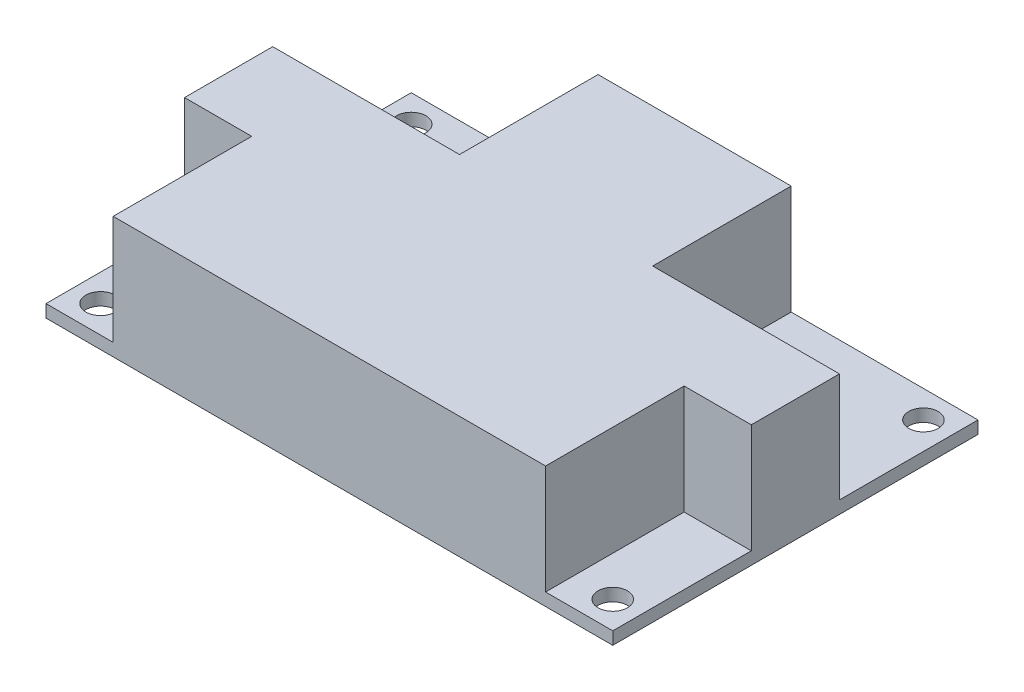
ISO-10303-21;
HEADER;
FILE_DESCRIPTION(('STEP AP214'),'2;1');
FILE_NAME('part.step','',(''),(''),'','','');
FILE_SCHEMA(('AUTOMOTIVE_DESIGN { 1 0 10303 214 1 1 1 1 }'));
ENDSEC;
DATA;
#1=APPLICATION_CONTEXT('core data for automotive mechanical design processes');
#2=APPLICATION_PROTOCOL_DEFINITION('international standard','automotive_design',2000,#1);
#3=PRODUCT_CONTEXT('',#1,'mechanical');
#4=PRODUCT('Part','Part','',(#3));
#5=PRODUCT_RELATED_PRODUCT_CATEGORY('part','',(#4));
#6=PRODUCT_DEFINITION_FORMATION('','',#4);
#7=PRODUCT_DEFINITION_CONTEXT('part definition',#1,'design');
#8=PRODUCT_DEFINITION('design','',#6,#7);
#9=PRODUCT_DEFINITION_SHAPE('','',#8);
#10=(LENGTH_UNIT() NAMED_UNIT(*) SI_UNIT(.MILLI.,.METRE.));
#11=(NAMED_UNIT(*) PLANE_ANGLE_UNIT() SI_UNIT($,.RADIAN.));
#12=(NAMED_UNIT(*) SI_UNIT($,.STERADIAN.) SOLID_ANGLE_UNIT());
#13=UNCERTAINTY_MEASURE_WITH_UNIT(LENGTH_MEASURE(1.E-05),#10,'distance_accuracy_value','');
#14=(GEOMETRIC_REPRESENTATION_CONTEXT(3) GLOBAL_UNCERTAINTY_ASSIGNED_CONTEXT((#13)) GLOBAL_UNIT_ASSIGNED_CONTEXT((#10,
#11,#12)) REPRESENTATION_CONTEXT('',''));
#15=CARTESIAN_POINT('',(0.,0.,0.));
#16=DIRECTION('',(0.,0.,1.));
#17=DIRECTION('',(1.,0.,0.));
#18=AXIS2_PLACEMENT_3D('',#15,#16,#17);
#19=CARTESIAN_POINT('',(0.,1.5,0.));
#20=DIRECTION('',(0.,-1.,0.));
#21=DIRECTION('',(0.,0.,-1.));
#22=AXIS2_PLACEMENT_3D('',#19,#20,#21);
#23=PLANE('',#22);
#24=CARTESIAN_POINT('',(3.25,1.5,-40.25));
#25=DIRECTION('',(0.,1.,0.));
#26=DIRECTION('',(0.,0.,1.));
#27=AXIS2_PLACEMENT_3D('',#24,#25,#26);
#28=CIRCLE('',#27,1.75);
#29=CARTESIAN_POINT('',(3.25,1.5,-38.5));
#30=VERTEX_POINT('',#29);
#31=EDGE_CURVE('E201',#30,#30,#28,.T.);
#32=ORIENTED_EDGE('',*,*,#31,.F.);
#33=EDGE_LOOP('',(#32));
#34=FACE_BOUND('',#33,.T.);
#35=DIRECTION('',(-1.,0.,0.));
#36=VECTOR('',#35,1.);
#37=CARTESIAN_POINT('',(0.,1.5,-27.));
#38=LINE('',#37,#36);
#39=CARTESIAN_POINT('',(22.25,1.5,-27.));
#40=VERTEX_POINT('',#39);
#41=CARTESIAN_POINT('',(0.,1.5,-27.));
#42=VERTEX_POINT('',#41);
#43=EDGE_CURVE('E54',#40,#42,#38,.T.);
#44=ORIENTED_EDGE('',*,*,#43,.F.);
#45=DIRECTION('',(0.,0.,1.));
#46=VECTOR('',#45,1.);
#47=CARTESIAN_POINT('',(22.25,1.5,-43.5));
#48=LINE('',#47,#46);
#49=CARTESIAN_POINT('',(22.25,1.5,-43.5));
#50=VERTEX_POINT('',#49);
#51=EDGE_CURVE('E257',#50,#40,#48,.T.);
#52=ORIENTED_EDGE('',*,*,#51,.F.);
#53=DIRECTION('',(-1.,0.,0.));
#54=VECTOR('',#53,1.);
#55=CARTESIAN_POINT('',(0.,1.5,-43.5));
#56=LINE('',#55,#54);
#57=CARTESIAN_POINT('',(0.,1.5,-43.5));
#58=VERTEX_POINT('',#57);
#59=EDGE_CURVE('E215',#50,#58,#56,.T.);
#60=ORIENTED_EDGE('',*,*,#59,.T.);
#61=DIRECTION('',(0.,0.,1.));
#62=VECTOR('',#61,1.);
#63=CARTESIAN_POINT('',(0.,1.5,0.));
#64=LINE('',#63,#62);
#65=EDGE_CURVE('E207',#58,#42,#64,.T.);
#66=ORIENTED_EDGE('',*,*,#65,.T.);
#67=EDGE_LOOP('',(#44,#52,#60,#66));
#68=FACE_BOUND('',#67,.T.);
#69=ADVANCED_FACE('F39',(#34,#68),#23,.F.);
#70=CARTESIAN_POINT('',(64.25,1.5,-40.25));
#71=DIRECTION('',(0.,1.,0.));
#72=DIRECTION('',(0.,0.,1.));
#73=AXIS2_PLACEMENT_3D('',#70,#71,#72);
#74=CIRCLE('',#73,1.75);
#75=CARTESIAN_POINT('',(64.25,1.5,-38.5));
#76=VERTEX_POINT('',#75);
#77=EDGE_CURVE('E195',#76,#76,#74,.T.);
#78=ORIENTED_EDGE('',*,*,#77,.F.);
#79=EDGE_LOOP('',(#78));
#80=FACE_BOUND('',#79,.T.);
#81=DIRECTION('',(0.,0.,-1.));
#82=VECTOR('',#81,1.);
#83=CARTESIAN_POINT('',(45.25,1.5,-43.5));
#84=LINE('',#83,#82);
#85=CARTESIAN_POINT('',(45.25,1.5,-27.));
#86=VERTEX_POINT('',#85);
#87=CARTESIAN_POINT('',(45.25,1.5,-43.5));
#88=VERTEX_POINT('',#87);
#89=EDGE_CURVE('E62',#86,#88,#84,.T.);
#90=ORIENTED_EDGE('',*,*,#89,.F.);
#91=DIRECTION('',(-1.,0.,0.));
#92=VECTOR('',#91,1.);
#93=CARTESIAN_POINT('',(67.5,1.5,-27.));
#94=LINE('',#93,#92);
#95=CARTESIAN_POINT('',(67.5,1.5,-27.));
#96=VERTEX_POINT('',#95);
#97=EDGE_CURVE('E306',#96,#86,#94,.T.);
#98=ORIENTED_EDGE('',*,*,#97,.F.);
#99=DIRECTION('',(0.,0.,-1.));
#100=VECTOR('',#99,1.);
#101=CARTESIAN_POINT('',(67.5,1.5,0.));
#102=LINE('',#101,#100);
#103=CARTESIAN_POINT('',(67.5,1.5,-43.5));
#104=VERTEX_POINT('',#103);
#105=EDGE_CURVE('E212',#96,#104,#102,.T.);
#106=ORIENTED_EDGE('',*,*,#105,.T.);
#107=EDGE_CURVE('E216',#104,#88,#56,.T.);
#108=ORIENTED_EDGE('',*,*,#107,.T.);
#109=EDGE_LOOP('',(#90,#98,#106,#108));
#110=FACE_BOUND('',#109,.T.);
#111=ADVANCED_FACE('F345',(#80,#110),#23,.F.);
#112=CARTESIAN_POINT('',(64.25,1.5,-3.25));
#113=DIRECTION('',(0.,1.,0.));
#114=DIRECTION('',(0.,0.,1.));
#115=AXIS2_PLACEMENT_3D('',#112,#113,#114);
#116=CIRCLE('',#115,1.75);
#117=CARTESIAN_POINT('',(64.25,1.5,-1.5));
#118=VERTEX_POINT('',#117);
#119=EDGE_CURVE('E189',#118,#118,#116,.T.);
#120=ORIENTED_EDGE('',*,*,#119,.F.);
#121=EDGE_LOOP('',(#120));
#122=FACE_BOUND('',#121,.T.);
#123=DIRECTION('',(1.,0.,0.));
#124=VECTOR('',#123,1.);
#125=CARTESIAN_POINT('',(67.5,1.5,-16.5));
#126=LINE('',#125,#124);
#127=CARTESIAN_POINT('',(59.5,1.5,-16.5));
#128=VERTEX_POINT('',#127);
#129=CARTESIAN_POINT('',(67.5,1.5,-16.5));
#130=VERTEX_POINT('',#129);
#131=EDGE_CURVE('E299',#128,#130,#126,.T.);
#132=ORIENTED_EDGE('',*,*,#131,.F.);
#133=DIRECTION('',(0.,0.,-1.));
#134=VECTOR('',#133,1.);
#135=CARTESIAN_POINT('',(59.5,1.5,-16.5));
#136=LINE('',#135,#134);
#137=CARTESIAN_POINT('',(59.5,1.5,0.));
#138=VERTEX_POINT('',#137);
#139=EDGE_CURVE('E295',#138,#128,#136,.T.);
#140=ORIENTED_EDGE('',*,*,#139,.F.);
#141=DIRECTION('',(1.,0.,0.));
#142=VECTOR('',#141,1.);
#143=CARTESIAN_POINT('',(0.,1.5,0.));
#144=LINE('',#143,#142);
#145=CARTESIAN_POINT('',(67.5,1.5,0.));
#146=VERTEX_POINT('',#145);
#147=EDGE_CURVE('E209',#138,#146,#144,.T.);
#148=ORIENTED_EDGE('',*,*,#147,.T.);
#149=EDGE_CURVE('E213',#146,#130,#102,.T.);
#150=ORIENTED_EDGE('',*,*,#149,.T.);
#151=EDGE_LOOP('',(#132,#140,#148,#150));
#152=FACE_BOUND('',#151,.T.);
#153=ADVANCED_FACE('F347',(#122,#152),#23,.F.);
#154=CARTESIAN_POINT('',(3.25,1.5,-3.25));
#155=DIRECTION('',(0.,1.,0.));
#156=DIRECTION('',(0.,0.,1.));
#157=AXIS2_PLACEMENT_3D('',#154,#155,#156);
#158=CIRCLE('',#157,1.75);
#159=CARTESIAN_POINT('',(3.25,1.5,-1.5));
#160=VERTEX_POINT('',#159);
#161=EDGE_CURVE('E180',#160,#160,#158,.T.);
#162=ORIENTED_EDGE('',*,*,#161,.F.);
#163=EDGE_LOOP('',(#162));
#164=FACE_BOUND('',#163,.T.);
#165=DIRECTION('',(0.,0.,1.));
#166=VECTOR('',#165,1.);
#167=CARTESIAN_POINT('',(8.,1.5,-16.5));
#168=LINE('',#167,#166);
#169=CARTESIAN_POINT('',(8.,1.5,-16.5));
#170=VERTEX_POINT('',#169);
#171=CARTESIAN_POINT('',(8.,1.5,0.));
#172=VERTEX_POINT('',#171);
#173=EDGE_CURVE('E293',#170,#172,#168,.T.);
#174=ORIENTED_EDGE('',*,*,#173,.F.);
#175=DIRECTION('',(1.,0.,0.));
#176=VECTOR('',#175,1.);
#177=CARTESIAN_POINT('',(0.,1.5,-16.5));
#178=LINE('',#177,#176);
#179=CARTESIAN_POINT('',(0.,1.5,-16.5));
#180=VERTEX_POINT('',#179);
#181=EDGE_CURVE('E296',#180,#170,#178,.T.);
#182=ORIENTED_EDGE('',*,*,#181,.F.);
#183=CARTESIAN_POINT('',(0.,1.5,0.));
#184=VERTEX_POINT('',#183);
#185=EDGE_CURVE('E176',#180,#184,#64,.T.);
#186=ORIENTED_EDGE('',*,*,#185,.T.);
#187=EDGE_CURVE('E210',#184,#172,#144,.T.);
#188=ORIENTED_EDGE('',*,*,#187,.T.);
#189=EDGE_LOOP('',(#174,#182,#186,#188));
#190=FACE_BOUND('',#189,.T.);
#191=ADVANCED_FACE('F354',(#164,#190),#23,.F.);
#192=CARTESIAN_POINT('',(0.,0.,0.));
#193=DIRECTION('',(0.,-1.,0.));
#194=DIRECTION('',(0.,0.,-1.));
#195=AXIS2_PLACEMENT_3D('',#192,#193,#194);
#196=PLANE('',#195);
#197=CARTESIAN_POINT('',(64.25,0.,-3.25));
#198=DIRECTION('',(0.,1.,0.));
#199=DIRECTION('',(0.,0.,1.));
#200=AXIS2_PLACEMENT_3D('',#197,#198,#199);
#201=CIRCLE('',#200,1.75);
#202=CARTESIAN_POINT('',(64.25,0.,-1.5));
#203=VERTEX_POINT('',#202);
#204=EDGE_CURVE('E187',#203,#203,#201,.T.);
#205=ORIENTED_EDGE('',*,*,#204,.T.);
#206=EDGE_LOOP('',(#205));
#207=FACE_BOUND('',#206,.T.);
#208=CARTESIAN_POINT('',(3.25,0.,-40.25));
#209=DIRECTION('',(0.,1.,0.));
#210=DIRECTION('',(0.,0.,1.));
#211=AXIS2_PLACEMENT_3D('',#208,#209,#210);
#212=CIRCLE('',#211,1.75);
#213=CARTESIAN_POINT('',(3.25,0.,-38.5));
#214=VERTEX_POINT('',#213);
#215=EDGE_CURVE('E198',#214,#214,#212,.T.);
#216=ORIENTED_EDGE('',*,*,#215,.T.);
#217=EDGE_LOOP('',(#216));
#218=FACE_BOUND('',#217,.T.);
#219=DIRECTION('',(0.,0.,1.));
#220=VECTOR('',#219,1.);
#221=CARTESIAN_POINT('',(0.,0.,0.));
#222=LINE('',#221,#220);
#223=CARTESIAN_POINT('',(0.,0.,-43.5));
#224=VERTEX_POINT('',#223);
#225=CARTESIAN_POINT('',(0.,0.,0.));
#226=VERTEX_POINT('',#225);
#227=EDGE_CURVE('E204',#224,#226,#222,.T.);
#228=ORIENTED_EDGE('',*,*,#227,.F.);
#229=DIRECTION('',(-1.,0.,0.));
#230=VECTOR('',#229,1.);
#231=CARTESIAN_POINT('',(0.,0.,-43.5));
#232=LINE('',#231,#230);
#233=CARTESIAN_POINT('',(67.5,0.,-43.5));
#234=VERTEX_POINT('',#233);
#235=EDGE_CURVE('E224',#234,#224,#232,.T.);
#236=ORIENTED_EDGE('',*,*,#235,.F.);
#237=DIRECTION('',(0.,0.,-1.));
#238=VECTOR('',#237,1.);
#239=CARTESIAN_POINT('',(67.5,0.,0.));
#240=LINE('',#239,#238);
#241=CARTESIAN_POINT('',(67.5,0.,0.));
#242=VERTEX_POINT('',#241);
#243=EDGE_CURVE('E222',#242,#234,#240,.T.);
#244=ORIENTED_EDGE('',*,*,#243,.F.);
#245=DIRECTION('',(1.,0.,0.));
#246=VECTOR('',#245,1.);
#247=CARTESIAN_POINT('',(0.,0.,0.));
#248=LINE('',#247,#246);
#249=EDGE_CURVE('E220',#226,#242,#248,.T.);
#250=ORIENTED_EDGE('',*,*,#249,.F.);
#251=EDGE_LOOP('',(#228,#236,#244,#250));
#252=FACE_BOUND('',#251,.T.);
#253=CARTESIAN_POINT('',(64.25,0.,-40.25));
#254=DIRECTION('',(0.,1.,0.));
#255=DIRECTION('',(0.,0.,1.));
#256=AXIS2_PLACEMENT_3D('',#253,#254,#255);
#257=CIRCLE('',#256,1.75);
#258=CARTESIAN_POINT('',(64.25,0.,-38.5));
#259=VERTEX_POINT('',#258);
#260=EDGE_CURVE('E192',#259,#259,#257,.T.);
#261=ORIENTED_EDGE('',*,*,#260,.T.);
#262=EDGE_LOOP('',(#261));
#263=FACE_BOUND('',#262,.T.);
#264=CARTESIAN_POINT('',(3.25,0.,-3.25));
#265=DIRECTION('',(0.,1.,0.));
#266=DIRECTION('',(0.,0.,1.));
#267=AXIS2_PLACEMENT_3D('',#264,#265,#266);
#268=CIRCLE('',#267,1.75);
#269=CARTESIAN_POINT('',(3.25,0.,-1.5));
#270=VERTEX_POINT('',#269);
#271=EDGE_CURVE('E177',#270,#270,#268,.T.);
#272=ORIENTED_EDGE('',*,*,#271,.T.);
#273=EDGE_LOOP('',(#272));
#274=FACE_BOUND('',#273,.T.);
#275=ADVANCED_FACE('F243',(#207,#218,#252,#263,#274),#196,.T.);
#276=CARTESIAN_POINT('',(0.,1.5,0.));
#277=DIRECTION('',(1.,0.,0.));
#278=DIRECTION('',(0.,0.,-1.));
#279=AXIS2_PLACEMENT_3D('',#276,#277,#278);
#280=PLANE('',#279);
#281=ORIENTED_EDGE('',*,*,#227,.T.);
#282=DIRECTION('',(0.,-1.,0.));
#283=VECTOR('',#282,1.);
#284=CARTESIAN_POINT('',(0.,1.5,0.));
#285=LINE('',#284,#283);
#286=EDGE_CURVE('E11',#184,#226,#285,.T.);
#287=ORIENTED_EDGE('',*,*,#286,.F.);
#288=ORIENTED_EDGE('',*,*,#185,.F.);
#289=DIRECTION('',(0.,-1.,0.));
#290=VECTOR('',#289,1.);
#291=CARTESIAN_POINT('',(0.,14.5,-16.5));
#292=LINE('',#291,#290);
#293=CARTESIAN_POINT('',(0.,14.5,-16.5));
#294=VERTEX_POINT('',#293);
#295=EDGE_CURVE('E157',#294,#180,#292,.T.);
#296=ORIENTED_EDGE('',*,*,#295,.F.);
#297=DIRECTION('',(0.,0.,1.));
#298=VECTOR('',#297,1.);
#299=CARTESIAN_POINT('',(0.,14.5,-27.));
#300=LINE('',#299,#298);
#301=CARTESIAN_POINT('',(0.,14.5,-27.));
#302=VERTEX_POINT('',#301);
#303=EDGE_CURVE('E163',#302,#294,#300,.T.);
#304=ORIENTED_EDGE('',*,*,#303,.F.);
#305=DIRECTION('',(0.,-1.,0.));
#306=VECTOR('',#305,1.);
#307=CARTESIAN_POINT('',(0.,14.5,-27.));
#308=LINE('',#307,#306);
#309=EDGE_CURVE('E251',#302,#42,#308,.T.);
#310=ORIENTED_EDGE('',*,*,#309,.T.);
#311=ORIENTED_EDGE('',*,*,#65,.F.);
#312=DIRECTION('',(0.,-1.,0.));
#313=VECTOR('',#312,1.);
#314=CARTESIAN_POINT('',(0.,1.5,-43.5));
#315=LINE('',#314,#313);
#316=EDGE_CURVE('E218',#58,#224,#315,.T.);
#317=ORIENTED_EDGE('',*,*,#316,.T.);
#318=EDGE_LOOP('',(#281,#287,#288,#296,#304,#310,#311,#317));
#319=FACE_BOUND('',#318,.T.);
#320=ADVANCED_FACE('F41',(#319),#280,.F.);
#321=CARTESIAN_POINT('',(0.,1.5,0.));
#322=DIRECTION('',(0.,0.,-1.));
#323=DIRECTION('',(-1.,0.,0.));
#324=AXIS2_PLACEMENT_3D('',#321,#322,#323);
#325=PLANE('',#324);
#326=ORIENTED_EDGE('',*,*,#249,.T.);
#327=DIRECTION('',(0.,-1.,0.));
#328=VECTOR('',#327,1.);
#329=CARTESIAN_POINT('',(67.5,1.5,0.));
#330=LINE('',#329,#328);
#331=EDGE_CURVE('E47',#146,#242,#330,.T.);
#332=ORIENTED_EDGE('',*,*,#331,.F.);
#333=ORIENTED_EDGE('',*,*,#147,.F.);
#334=DIRECTION('',(0.,-1.,0.));
#335=VECTOR('',#334,1.);
#336=CARTESIAN_POINT('',(59.5,14.5,0.));
#337=LINE('',#336,#335);
#338=CARTESIAN_POINT('',(59.5,14.5,0.));
#339=VERTEX_POINT('',#338);
#340=EDGE_CURVE('E281',#339,#138,#337,.T.);
#341=ORIENTED_EDGE('',*,*,#340,.F.);
#342=DIRECTION('',(1.,0.,0.));
#343=VECTOR('',#342,1.);
#344=CARTESIAN_POINT('',(8.,14.5,0.));
#345=LINE('',#344,#343);
#346=CARTESIAN_POINT('',(8.,14.5,0.));
#347=VERTEX_POINT('',#346);
#348=EDGE_CURVE('E289',#347,#339,#345,.T.);
#349=ORIENTED_EDGE('',*,*,#348,.F.);
#350=DIRECTION('',(0.,-1.,0.));
#351=VECTOR('',#350,1.);
#352=CARTESIAN_POINT('',(8.,14.5,0.));
#353=LINE('',#352,#351);
#354=EDGE_CURVE('E182',#347,#172,#353,.T.);
#355=ORIENTED_EDGE('',*,*,#354,.T.);
#356=ORIENTED_EDGE('',*,*,#187,.F.);
#357=ORIENTED_EDGE('',*,*,#286,.T.);
#358=EDGE_LOOP('',(#326,#332,#333,#341,#349,#355,#356,#357));
#359=FACE_BOUND('',#358,.T.);
#360=ADVANCED_FACE('F287',(#359),#325,.F.);
#361=CARTESIAN_POINT('',(67.5,1.5,0.));
#362=DIRECTION('',(-1.,0.,0.));
#363=DIRECTION('',(0.,0.,1.));
#364=AXIS2_PLACEMENT_3D('',#361,#362,#363);
#365=PLANE('',#364);
#366=ORIENTED_EDGE('',*,*,#243,.T.);
#367=DIRECTION('',(0.,-1.,0.));
#368=VECTOR('',#367,1.);
#369=CARTESIAN_POINT('',(67.5,1.5,-43.5));
#370=LINE('',#369,#368);
#371=EDGE_CURVE('E228',#104,#234,#370,.T.);
#372=ORIENTED_EDGE('',*,*,#371,.F.);
#373=ORIENTED_EDGE('',*,*,#105,.F.);
#374=DIRECTION('',(0.,-1.,0.));
#375=VECTOR('',#374,1.);
#376=CARTESIAN_POINT('',(67.5,14.5,-27.));
#377=LINE('',#376,#375);
#378=CARTESIAN_POINT('',(67.5,14.5,-27.));
#379=VERTEX_POINT('',#378);
#380=EDGE_CURVE('E273',#379,#96,#377,.T.);
#381=ORIENTED_EDGE('',*,*,#380,.F.);
#382=DIRECTION('',(0.,0.,-1.));
#383=VECTOR('',#382,1.);
#384=CARTESIAN_POINT('',(67.5,14.5,-27.));
#385=LINE('',#384,#383);
#386=CARTESIAN_POINT('',(67.5,14.5,-16.5));
#387=VERTEX_POINT('',#386);
#388=EDGE_CURVE('E324',#387,#379,#385,.T.);
#389=ORIENTED_EDGE('',*,*,#388,.F.);
#390=DIRECTION('',(0.,-1.,0.));
#391=VECTOR('',#390,1.);
#392=CARTESIAN_POINT('',(67.5,14.5,-16.5));
#393=LINE('',#392,#391);
#394=EDGE_CURVE('E276',#387,#130,#393,.T.);
#395=ORIENTED_EDGE('',*,*,#394,.T.);
#396=ORIENTED_EDGE('',*,*,#149,.F.);
#397=ORIENTED_EDGE('',*,*,#331,.T.);
#398=EDGE_LOOP('',(#366,#372,#373,#381,#389,#395,#396,#397));
#399=FACE_BOUND('',#398,.T.);
#400=ADVANCED_FACE('F235',(#399),#365,.F.);
#401=CARTESIAN_POINT('',(0.,1.5,-43.5));
#402=DIRECTION('',(0.,0.,1.));
#403=DIRECTION('',(1.,0.,0.));
#404=AXIS2_PLACEMENT_3D('',#401,#402,#403);
#405=PLANE('',#404);
#406=ORIENTED_EDGE('',*,*,#235,.T.);
#407=ORIENTED_EDGE('',*,*,#316,.F.);
#408=ORIENTED_EDGE('',*,*,#59,.F.);
#409=DIRECTION('',(0.,-1.,0.));
#410=VECTOR('',#409,1.);
#411=CARTESIAN_POINT('',(22.25,14.5,-43.5));
#412=LINE('',#411,#410);
#413=CARTESIAN_POINT('',(22.25,14.5,-43.5));
#414=VERTEX_POINT('',#413);
#415=EDGE_CURVE('E264',#414,#50,#412,.T.);
#416=ORIENTED_EDGE('',*,*,#415,.F.);
#417=DIRECTION('',(-1.,0.,0.));
#418=VECTOR('',#417,1.);
#419=CARTESIAN_POINT('',(45.25,14.5,-43.5));
#420=LINE('',#419,#418);
#421=CARTESIAN_POINT('',(45.25,14.5,-43.5));
#422=VERTEX_POINT('',#421);
#423=EDGE_CURVE('E314',#422,#414,#420,.T.);
#424=ORIENTED_EDGE('',*,*,#423,.F.);
#425=DIRECTION('',(0.,-1.,0.));
#426=VECTOR('',#425,1.);
#427=CARTESIAN_POINT('',(45.25,14.5,-43.5));
#428=LINE('',#427,#426);
#429=EDGE_CURVE('E267',#422,#88,#428,.T.);
#430=ORIENTED_EDGE('',*,*,#429,.T.);
#431=ORIENTED_EDGE('',*,*,#107,.F.);
#432=ORIENTED_EDGE('',*,*,#371,.T.);
#433=EDGE_LOOP('',(#406,#407,#408,#416,#424,#430,#431,#432));
#434=FACE_BOUND('',#433,.T.);
#435=ADVANCED_FACE('F247',(#434),#405,.F.);
#436=CARTESIAN_POINT('',(3.25,1.5,-40.25));
#437=DIRECTION('',(0.,-1.,0.));
#438=DIRECTION('',(0.,0.,-1.));
#439=AXIS2_PLACEMENT_3D('',#436,#437,#438);
#440=CYLINDRICAL_SURFACE('',#439,1.75);
#441=ORIENTED_EDGE('',*,*,#31,.T.);
#442=EDGE_LOOP('',(#441));
#443=FACE_BOUND('',#442,.T.);
#444=ORIENTED_EDGE('',*,*,#215,.F.);
#445=EDGE_LOOP('',(#444));
#446=FACE_BOUND('',#445,.T.);
#447=ADVANCED_FACE('F360',(#443,#446),#440,.F.);
#448=CARTESIAN_POINT('',(64.25,1.5,-40.25));
#449=DIRECTION('',(0.,-1.,0.));
#450=DIRECTION('',(0.,0.,-1.));
#451=AXIS2_PLACEMENT_3D('',#448,#449,#450);
#452=CYLINDRICAL_SURFACE('',#451,1.75);
#453=ORIENTED_EDGE('',*,*,#77,.T.);
#454=EDGE_LOOP('',(#453));
#455=FACE_BOUND('',#454,.T.);
#456=ORIENTED_EDGE('',*,*,#260,.F.);
#457=EDGE_LOOP('',(#456));
#458=FACE_BOUND('',#457,.T.);
#459=ADVANCED_FACE('F424',(#455,#458),#452,.F.);
#460=CARTESIAN_POINT('',(64.25,1.5,-3.25));
#461=DIRECTION('',(0.,-1.,0.));
#462=DIRECTION('',(0.,0.,-1.));
#463=AXIS2_PLACEMENT_3D('',#460,#461,#462);
#464=CYLINDRICAL_SURFACE('',#463,1.75);
#465=ORIENTED_EDGE('',*,*,#119,.T.);
#466=EDGE_LOOP('',(#465));
#467=FACE_BOUND('',#466,.T.);
#468=ORIENTED_EDGE('',*,*,#204,.F.);
#469=EDGE_LOOP('',(#468));
#470=FACE_BOUND('',#469,.T.);
#471=ADVANCED_FACE('F411',(#467,#470),#464,.F.);
#472=CARTESIAN_POINT('',(3.25,1.5,-3.25));
#473=DIRECTION('',(0.,-1.,0.));
#474=DIRECTION('',(0.,0.,-1.));
#475=AXIS2_PLACEMENT_3D('',#472,#473,#474);
#476=CYLINDRICAL_SURFACE('',#475,1.75);
#477=ORIENTED_EDGE('',*,*,#161,.T.);
#478=EDGE_LOOP('',(#477));
#479=FACE_BOUND('',#478,.T.);
#480=ORIENTED_EDGE('',*,*,#271,.F.);
#481=EDGE_LOOP('',(#480));
#482=FACE_BOUND('',#481,.T.);
#483=ADVANCED_FACE('F406',(#479,#482),#476,.F.);
#484=CARTESIAN_POINT('',(0.,14.5,-16.5));
#485=DIRECTION('',(0.,0.,-1.));
#486=DIRECTION('',(-1.,0.,0.));
#487=AXIS2_PLACEMENT_3D('',#484,#485,#486);
#488=PLANE('',#487);
#489=ORIENTED_EDGE('',*,*,#181,.T.);
#490=DIRECTION('',(0.,-1.,0.));
#491=VECTOR('',#490,1.);
#492=CARTESIAN_POINT('',(8.,14.5,-16.5));
#493=LINE('',#492,#491);
#494=CARTESIAN_POINT('',(8.,14.5,-16.5));
#495=VERTEX_POINT('',#494);
#496=EDGE_CURVE('E159',#495,#170,#493,.T.);
#497=ORIENTED_EDGE('',*,*,#496,.F.);
#498=DIRECTION('',(1.,0.,0.));
#499=VECTOR('',#498,1.);
#500=CARTESIAN_POINT('',(0.,14.5,-16.5));
#501=LINE('',#500,#499);
#502=EDGE_CURVE('E152',#294,#495,#501,.T.);
#503=ORIENTED_EDGE('',*,*,#502,.F.);
#504=ORIENTED_EDGE('',*,*,#295,.T.);
#505=EDGE_LOOP('',(#489,#497,#503,#504));
#506=FACE_BOUND('',#505,.T.);
#507=ADVANCED_FACE('F155',(#506),#488,.F.);
#508=CARTESIAN_POINT('',(8.,14.5,-16.5));
#509=DIRECTION('',(1.,0.,0.));
#510=DIRECTION('',(0.,0.,-1.));
#511=AXIS2_PLACEMENT_3D('',#508,#509,#510);
#512=PLANE('',#511);
#513=ORIENTED_EDGE('',*,*,#173,.T.);
#514=ORIENTED_EDGE('',*,*,#354,.F.);
#515=DIRECTION('',(0.,0.,1.));
#516=VECTOR('',#515,1.);
#517=CARTESIAN_POINT('',(8.,14.5,-16.5));
#518=LINE('',#517,#516);
#519=EDGE_CURVE('E162',#495,#347,#518,.T.);
#520=ORIENTED_EDGE('',*,*,#519,.F.);
#521=ORIENTED_EDGE('',*,*,#496,.T.);
#522=EDGE_LOOP('',(#513,#514,#520,#521));
#523=FACE_BOUND('',#522,.T.);
#524=ADVANCED_FACE('F292',(#523),#512,.F.);
#525=CARTESIAN_POINT('',(59.5,14.5,-16.5));
#526=DIRECTION('',(-1.,0.,0.));
#527=DIRECTION('',(0.,0.,1.));
#528=AXIS2_PLACEMENT_3D('',#525,#526,#527);
#529=PLANE('',#528);
#530=ORIENTED_EDGE('',*,*,#139,.T.);
#531=DIRECTION('',(0.,-1.,0.));
#532=VECTOR('',#531,1.);
#533=CARTESIAN_POINT('',(59.5,14.5,-16.5));
#534=LINE('',#533,#532);
#535=CARTESIAN_POINT('',(59.5,14.5,-16.5));
#536=VERTEX_POINT('',#535);
#537=EDGE_CURVE('E278',#536,#128,#534,.T.);
#538=ORIENTED_EDGE('',*,*,#537,.F.);
#539=DIRECTION('',(0.,0.,-1.));
#540=VECTOR('',#539,1.);
#541=CARTESIAN_POINT('',(59.5,14.5,-16.5));
#542=LINE('',#541,#540);
#543=EDGE_CURVE('E328',#339,#536,#542,.T.);
#544=ORIENTED_EDGE('',*,*,#543,.F.);
#545=ORIENTED_EDGE('',*,*,#340,.T.);
#546=EDGE_LOOP('',(#530,#538,#544,#545));
#547=FACE_BOUND('',#546,.T.);
#548=ADVANCED_FACE('F334',(#547),#529,.F.);
#549=CARTESIAN_POINT('',(67.5,14.5,-16.5));
#550=DIRECTION('',(0.,0.,-1.));
#551=DIRECTION('',(-1.,0.,0.));
#552=AXIS2_PLACEMENT_3D('',#549,#550,#551);
#553=PLANE('',#552);
#554=ORIENTED_EDGE('',*,*,#131,.T.);
#555=ORIENTED_EDGE('',*,*,#394,.F.);
#556=DIRECTION('',(1.,0.,0.));
#557=VECTOR('',#556,1.);
#558=CARTESIAN_POINT('',(67.5,14.5,-16.5));
#559=LINE('',#558,#557);
#560=EDGE_CURVE('E326',#536,#387,#559,.T.);
#561=ORIENTED_EDGE('',*,*,#560,.F.);
#562=ORIENTED_EDGE('',*,*,#537,.T.);
#563=EDGE_LOOP('',(#554,#555,#561,#562));
#564=FACE_BOUND('',#563,.T.);
#565=ADVANCED_FACE('F338',(#564),#553,.F.);
#566=CARTESIAN_POINT('',(67.5,14.5,-27.));
#567=DIRECTION('',(0.,0.,1.));
#568=DIRECTION('',(1.,0.,0.));
#569=AXIS2_PLACEMENT_3D('',#566,#567,#568);
#570=PLANE('',#569);
#571=ORIENTED_EDGE('',*,*,#97,.T.);
#572=DIRECTION('',(0.,-1.,0.));
#573=VECTOR('',#572,1.);
#574=CARTESIAN_POINT('',(45.25,14.5,-27.));
#575=LINE('',#574,#573);
#576=CARTESIAN_POINT('',(45.25,14.5,-27.));
#577=VERTEX_POINT('',#576);
#578=EDGE_CURVE('E270',#577,#86,#575,.T.);
#579=ORIENTED_EDGE('',*,*,#578,.F.);
#580=DIRECTION('',(-1.,0.,0.));
#581=VECTOR('',#580,1.);
#582=CARTESIAN_POINT('',(67.5,14.5,-27.));
#583=LINE('',#582,#581);
#584=EDGE_CURVE('E320',#379,#577,#583,.T.);
#585=ORIENTED_EDGE('',*,*,#584,.F.);
#586=ORIENTED_EDGE('',*,*,#380,.T.);
#587=EDGE_LOOP('',(#571,#579,#585,#586));
#588=FACE_BOUND('',#587,.T.);
#589=ADVANCED_FACE('F344',(#588),#570,.F.);
#590=CARTESIAN_POINT('',(45.25,14.5,-43.5));
#591=DIRECTION('',(-1.,0.,0.));
#592=DIRECTION('',(0.,0.,1.));
#593=AXIS2_PLACEMENT_3D('',#590,#591,#592);
#594=PLANE('',#593);
#595=ORIENTED_EDGE('',*,*,#89,.T.);
#596=ORIENTED_EDGE('',*,*,#429,.F.);
#597=DIRECTION('',(0.,0.,-1.));
#598=VECTOR('',#597,1.);
#599=CARTESIAN_POINT('',(45.25,14.5,-43.5));
#600=LINE('',#599,#598);
#601=EDGE_CURVE('E317',#577,#422,#600,.T.);
#602=ORIENTED_EDGE('',*,*,#601,.F.);
#603=ORIENTED_EDGE('',*,*,#578,.T.);
#604=EDGE_LOOP('',(#595,#596,#602,#603));
#605=FACE_BOUND('',#604,.T.);
#606=ADVANCED_FACE('F309',(#605),#594,.F.);
#607=CARTESIAN_POINT('',(22.25,14.5,-43.5));
#608=DIRECTION('',(1.,0.,0.));
#609=DIRECTION('',(0.,0.,-1.));
#610=AXIS2_PLACEMENT_3D('',#607,#608,#609);
#611=PLANE('',#610);
#612=ORIENTED_EDGE('',*,*,#51,.T.);
#613=DIRECTION('',(0.,-1.,0.));
#614=VECTOR('',#613,1.);
#615=CARTESIAN_POINT('',(22.25,14.5,-27.));
#616=LINE('',#615,#614);
#617=CARTESIAN_POINT('',(22.25,14.5,-27.));
#618=VERTEX_POINT('',#617);
#619=EDGE_CURVE('E256',#618,#40,#616,.T.);
#620=ORIENTED_EDGE('',*,*,#619,.F.);
#621=DIRECTION('',(0.,0.,1.));
#622=VECTOR('',#621,1.);
#623=CARTESIAN_POINT('',(22.25,14.5,-43.5));
#624=LINE('',#623,#622);
#625=EDGE_CURVE('E316',#414,#618,#624,.T.);
#626=ORIENTED_EDGE('',*,*,#625,.F.);
#627=ORIENTED_EDGE('',*,*,#415,.T.);
#628=EDGE_LOOP('',(#612,#620,#626,#627));
#629=FACE_BOUND('',#628,.T.);
#630=ADVANCED_FACE('F538',(#629),#611,.F.);
#631=CARTESIAN_POINT('',(0.,14.5,-27.));
#632=DIRECTION('',(0.,0.,1.));
#633=DIRECTION('',(1.,0.,0.));
#634=AXIS2_PLACEMENT_3D('',#631,#632,#633);
#635=PLANE('',#634);
#636=ORIENTED_EDGE('',*,*,#43,.T.);
#637=ORIENTED_EDGE('',*,*,#309,.F.);
#638=DIRECTION('',(-1.,0.,0.));
#639=VECTOR('',#638,1.);
#640=CARTESIAN_POINT('',(0.,14.5,-27.));
#641=LINE('',#640,#639);
#642=EDGE_CURVE('E168',#618,#302,#641,.T.);
#643=ORIENTED_EDGE('',*,*,#642,.F.);
#644=ORIENTED_EDGE('',*,*,#619,.T.);
#645=EDGE_LOOP('',(#636,#637,#643,#644));
#646=FACE_BOUND('',#645,.T.);
#647=ADVANCED_FACE('F254',(#646),#635,.F.);
#648=CARTESIAN_POINT('',(0.,14.5,0.));
#649=DIRECTION('',(0.,1.,0.));
#650=DIRECTION('',(0.,0.,1.));
#651=AXIS2_PLACEMENT_3D('',#648,#649,#650);
#652=PLANE('',#651);
#653=ORIENTED_EDGE('',*,*,#303,.T.);
#654=ORIENTED_EDGE('',*,*,#502,.T.);
#655=ORIENTED_EDGE('',*,*,#519,.T.);
#656=ORIENTED_EDGE('',*,*,#348,.T.);
#657=ORIENTED_EDGE('',*,*,#543,.T.);
#658=ORIENTED_EDGE('',*,*,#560,.T.);
#659=ORIENTED_EDGE('',*,*,#388,.T.);
#660=ORIENTED_EDGE('',*,*,#584,.T.);
#661=ORIENTED_EDGE('',*,*,#601,.T.);
#662=ORIENTED_EDGE('',*,*,#423,.T.);
#663=ORIENTED_EDGE('',*,*,#625,.T.);
#664=ORIENTED_EDGE('',*,*,#642,.T.);
#665=EDGE_LOOP('',(#653,#654,#655,#656,#657,#658,#659,#660,#661,#662,#663,#664));
#666=FACE_BOUND('',#665,.T.);
#667=ADVANCED_FACE('F166',(#666),#652,.T.);
#668=CLOSED_SHELL('',(#69,#111,#153,#191,#275,#320,#360,#400,#435,#447,#459,#471,#483,#507,#524,
#548,#565,#589,#606,#630,#647,#667));
#669=MANIFOLD_SOLID_BREP('B2',#668);
#670=ADVANCED_BREP_SHAPE_REPRESENTATION('',(#18,#669),#14);
#671=SHAPE_DEFINITION_REPRESENTATION(#9,#670);
ENDSEC;
END-ISO-10303-21;
